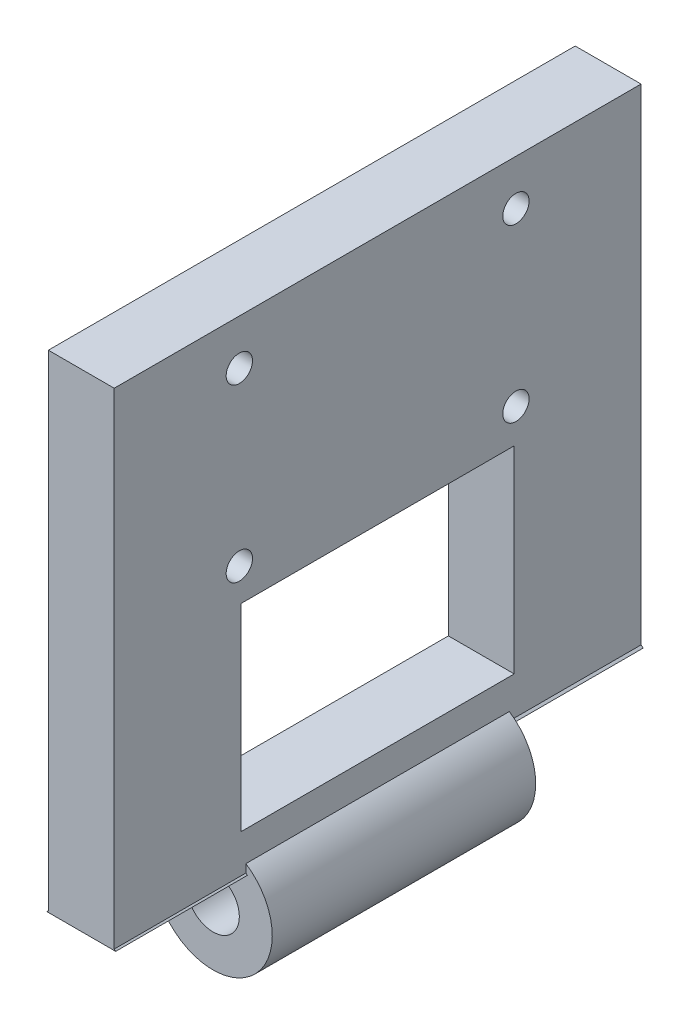
ISO-10303-21;
HEADER;
FILE_DESCRIPTION(('STEP AP214'),'2;1');
FILE_NAME('part.step','',(''),(''),'','','');
FILE_SCHEMA(('AUTOMOTIVE_DESIGN { 1 0 10303 214 1 1 1 1 }'));
ENDSEC;
DATA;
#1=APPLICATION_CONTEXT('core data for automotive mechanical design processes');
#2=APPLICATION_PROTOCOL_DEFINITION('international standard','automotive_design',2000,#1);
#3=PRODUCT_CONTEXT('',#1,'mechanical');
#4=PRODUCT('Part','Part','',(#3));
#5=PRODUCT_RELATED_PRODUCT_CATEGORY('part','',(#4));
#6=PRODUCT_DEFINITION_FORMATION('','',#4);
#7=PRODUCT_DEFINITION_CONTEXT('part definition',#1,'design');
#8=PRODUCT_DEFINITION('design','',#6,#7);
#9=PRODUCT_DEFINITION_SHAPE('','',#8);
#10=(LENGTH_UNIT() NAMED_UNIT(*) SI_UNIT(.MILLI.,.METRE.));
#11=(NAMED_UNIT(*) PLANE_ANGLE_UNIT() SI_UNIT($,.RADIAN.));
#12=(NAMED_UNIT(*) SI_UNIT($,.STERADIAN.) SOLID_ANGLE_UNIT());
#13=UNCERTAINTY_MEASURE_WITH_UNIT(LENGTH_MEASURE(1.E-05),#10,'distance_accuracy_value','');
#14=(GEOMETRIC_REPRESENTATION_CONTEXT(3) GLOBAL_UNCERTAINTY_ASSIGNED_CONTEXT((#13)) GLOBAL_UNIT_ASSIGNED_CONTEXT((#10,
#11,#12)) REPRESENTATION_CONTEXT('',''));
#15=CARTESIAN_POINT('',(0.,0.,0.));
#16=DIRECTION('',(0.,0.,1.));
#17=DIRECTION('',(1.,0.,0.));
#18=AXIS2_PLACEMENT_3D('',#15,#16,#17);
#19=CARTESIAN_POINT('',(5.,0.,0.));
#20=DIRECTION('',(-1.,0.,0.));
#21=DIRECTION('',(0.,0.,1.));
#22=AXIS2_PLACEMENT_3D('',#19,#20,#21);
#23=PLANE('',#22);
#24=CARTESIAN_POINT('',(5.,16.5612494995996,10.5));
#25=DIRECTION('',(1.,0.,0.));
#26=DIRECTION('',(0.,0.,-1.));
#27=AXIS2_PLACEMENT_3D('',#24,#25,#26);
#28=CIRCLE('',#27,1.);
#29=CARTESIAN_POINT('',(5.,16.5612494995996,9.5));
#30=VERTEX_POINT('',#29);
#31=EDGE_CURVE('E219',#30,#30,#28,.T.);
#32=ORIENTED_EDGE('',*,*,#31,.F.);
#33=EDGE_LOOP('',(#32));
#34=FACE_BOUND('',#33,.T.);
#35=CARTESIAN_POINT('',(5.,16.5612494995996,-10.5));
#36=DIRECTION('',(1.,0.,0.));
#37=DIRECTION('',(0.,0.,1.));
#38=AXIS2_PLACEMENT_3D('',#35,#36,#37);
#39=CIRCLE('',#38,1.);
#40=CARTESIAN_POINT('',(5.,16.5612494995996,-9.5));
#41=VERTEX_POINT('',#40);
#42=EDGE_CURVE('E216',#41,#41,#39,.T.);
#43=ORIENTED_EDGE('',*,*,#42,.F.);
#44=EDGE_LOOP('',(#43));
#45=FACE_BOUND('',#44,.T.);
#46=CARTESIAN_POINT('',(5.,3.5612494995996,-10.5));
#47=DIRECTION('',(1.,0.,0.));
#48=DIRECTION('',(0.,0.,-1.));
#49=AXIS2_PLACEMENT_3D('',#46,#47,#48);
#50=CIRCLE('',#49,1.);
#51=CARTESIAN_POINT('',(5.,3.5612494995996,-11.5));
#52=VERTEX_POINT('',#51);
#53=EDGE_CURVE('E220',#52,#52,#50,.T.);
#54=ORIENTED_EDGE('',*,*,#53,.F.);
#55=EDGE_LOOP('',(#54));
#56=FACE_BOUND('',#55,.T.);
#57=CARTESIAN_POINT('',(5.,3.56124949959959,10.5));
#58=DIRECTION('',(1.,0.,0.));
#59=DIRECTION('',(0.,0.,1.));
#60=AXIS2_PLACEMENT_3D('',#57,#58,#59);
#61=CIRCLE('',#60,1.);
#62=CARTESIAN_POINT('',(5.,3.56124949959959,11.5));
#63=VERTEX_POINT('',#62);
#64=EDGE_CURVE('E211',#63,#63,#61,.T.);
#65=ORIENTED_EDGE('',*,*,#64,.F.);
#66=EDGE_LOOP('',(#65));
#67=FACE_BOUND('',#66,.T.);
#68=DIRECTION('',(0.,1.,0.));
#69=VECTOR('',#68,1.);
#70=CARTESIAN_POINT('',(5.,-13.9716261909295,-10.3704912385666));
#71=LINE('',#70,#69);
#72=CARTESIAN_POINT('',(5.,-13.9716261909295,-10.3704912385666));
#73=VERTEX_POINT('',#72);
#74=CARTESIAN_POINT('',(5.,1.02837380907055,-10.3704912385666));
#75=VERTEX_POINT('',#74);
#76=EDGE_CURVE('E200',#73,#75,#71,.T.);
#77=ORIENTED_EDGE('',*,*,#76,.F.);
#78=DIRECTION('',(0.,0.,-1.));
#79=VECTOR('',#78,1.);
#80=CARTESIAN_POINT('',(5.,-13.9716261909295,10.3704912385666));
#81=LINE('',#80,#79);
#82=CARTESIAN_POINT('',(5.,-13.9716261909295,10.3704912385666));
#83=VERTEX_POINT('',#82);
#84=EDGE_CURVE('E62',#83,#73,#81,.T.);
#85=ORIENTED_EDGE('',*,*,#84,.F.);
#86=DIRECTION('',(0.,-1.,0.));
#87=VECTOR('',#86,1.);
#88=CARTESIAN_POINT('',(5.,-13.9716261909295,10.3704912385666));
#89=LINE('',#88,#87);
#90=CARTESIAN_POINT('',(5.,1.02837380907055,10.3704912385666));
#91=VERTEX_POINT('',#90);
#92=EDGE_CURVE('E205',#91,#83,#89,.T.);
#93=ORIENTED_EDGE('',*,*,#92,.F.);
#94=DIRECTION('',(0.,0.,1.));
#95=VECTOR('',#94,1.);
#96=CARTESIAN_POINT('',(5.,1.02837380907055,10.3704912385666));
#97=LINE('',#96,#95);
#98=EDGE_CURVE('E202',#75,#91,#97,.T.);
#99=ORIENTED_EDGE('',*,*,#98,.F.);
#100=EDGE_LOOP('',(#77,#85,#93,#99));
#101=FACE_BOUND('',#100,.T.);
#102=DIRECTION('',(0.,1.,0.));
#103=VECTOR('',#102,1.);
#104=CARTESIAN_POINT('',(5.,0.,-10.));
#105=LINE('',#104,#103);
#106=CARTESIAN_POINT('',(5.,-16.8775010008008,-9.99999999999999));
#107=VERTEX_POINT('',#106);
#108=CARTESIAN_POINT('',(5.,-16.2583426132261,-10.));
#109=VERTEX_POINT('',#108);
#110=EDGE_CURVE('E171',#107,#109,#105,.T.);
#111=ORIENTED_EDGE('',*,*,#110,.F.);
#112=DIRECTION('',(0.,0.,1.));
#113=VECTOR('',#112,1.);
#114=CARTESIAN_POINT('',(5.,-16.8775010008008,-31.3137084989848));
#115=LINE('',#114,#113);
#116=CARTESIAN_POINT('',(5.,-16.8775010008008,-20.));
#117=VERTEX_POINT('',#116);
#118=EDGE_CURVE('E242',#107,#117,#115,.F.);
#119=ORIENTED_EDGE('',*,*,#118,.T.);
#120=DIRECTION('',(0.,1.,0.));
#121=VECTOR('',#120,1.);
#122=CARTESIAN_POINT('',(5.,-20.,-20.));
#123=LINE('',#122,#121);
#124=CARTESIAN_POINT('',(5.,20.,-20.));
#125=VERTEX_POINT('',#124);
#126=EDGE_CURVE('E251',#117,#125,#123,.T.);
#127=ORIENTED_EDGE('',*,*,#126,.T.);
#128=DIRECTION('',(0.,0.,1.));
#129=VECTOR('',#128,1.);
#130=CARTESIAN_POINT('',(5.,20.,20.));
#131=LINE('',#130,#129);
#132=CARTESIAN_POINT('',(5.,20.,20.));
#133=VERTEX_POINT('',#132);
#134=EDGE_CURVE('E254',#125,#133,#131,.T.);
#135=ORIENTED_EDGE('',*,*,#134,.T.);
#136=DIRECTION('',(0.,-1.,0.));
#137=VECTOR('',#136,1.);
#138=CARTESIAN_POINT('',(5.,-20.,20.));
#139=LINE('',#138,#137);
#140=CARTESIAN_POINT('',(5.,-16.8775010008008,20.));
#141=VERTEX_POINT('',#140);
#142=EDGE_CURVE('E249',#133,#141,#139,.T.);
#143=ORIENTED_EDGE('',*,*,#142,.T.);
#144=CARTESIAN_POINT('',(5.,-16.8775010008008,10.));
#145=VERTEX_POINT('',#144);
#146=EDGE_CURVE('E185',#141,#145,#115,.F.);
#147=ORIENTED_EDGE('',*,*,#146,.T.);
#148=DIRECTION('',(0.,1.,0.));
#149=VECTOR('',#148,1.);
#150=CARTESIAN_POINT('',(5.,0.,10.));
#151=LINE('',#150,#149);
#152=CARTESIAN_POINT('',(5.,-16.2583426132261,10.));
#153=VERTEX_POINT('',#152);
#154=EDGE_CURVE('E176',#145,#153,#151,.T.);
#155=ORIENTED_EDGE('',*,*,#154,.T.);
#156=DIRECTION('',(0.,0.,1.));
#157=VECTOR('',#156,1.);
#158=CARTESIAN_POINT('',(5.,-16.2583426132261,-10.));
#159=LINE('',#158,#157);
#160=EDGE_CURVE('E161',#153,#109,#159,.F.);
#161=ORIENTED_EDGE('',*,*,#160,.T.);
#162=EDGE_LOOP('',(#111,#119,#127,#135,#143,#147,#155,#161));
#163=FACE_BOUND('',#162,.T.);
#164=ADVANCED_FACE('F47',(#34,#45,#56,#67,#101,#163),#23,.F.);
#165=CARTESIAN_POINT('',(0.,0.,0.));
#166=DIRECTION('',(-1.,0.,0.));
#167=DIRECTION('',(0.,0.,1.));
#168=AXIS2_PLACEMENT_3D('',#165,#166,#167);
#169=PLANE('',#168);
#170=DIRECTION('',(0.,0.,1.));
#171=VECTOR('',#170,1.);
#172=CARTESIAN_POINT('',(0.,-13.9716261909295,0.));
#173=LINE('',#172,#171);
#174=CARTESIAN_POINT('',(0.,-13.9716261909295,-10.3704912385666));
#175=VERTEX_POINT('',#174);
#176=CARTESIAN_POINT('',(0.,-13.9716261909295,10.3704912385666));
#177=VERTEX_POINT('',#176);
#178=EDGE_CURVE('E55',#175,#177,#173,.T.);
#179=ORIENTED_EDGE('',*,*,#178,.F.);
#180=DIRECTION('',(0.,-1.,0.));
#181=VECTOR('',#180,1.);
#182=CARTESIAN_POINT('',(0.,0.,-10.3704912385666));
#183=LINE('',#182,#181);
#184=CARTESIAN_POINT('',(0.,1.02837380907055,-10.3704912385666));
#185=VERTEX_POINT('',#184);
#186=EDGE_CURVE('E281',#185,#175,#183,.T.);
#187=ORIENTED_EDGE('',*,*,#186,.F.);
#188=DIRECTION('',(0.,0.,-1.));
#189=VECTOR('',#188,1.);
#190=CARTESIAN_POINT('',(0.,1.02837380907055,0.));
#191=LINE('',#190,#189);
#192=CARTESIAN_POINT('',(0.,1.02837380907055,10.3704912385666));
#193=VERTEX_POINT('',#192);
#194=EDGE_CURVE('E293',#193,#185,#191,.T.);
#195=ORIENTED_EDGE('',*,*,#194,.F.);
#196=DIRECTION('',(0.,1.,0.));
#197=VECTOR('',#196,1.);
#198=CARTESIAN_POINT('',(0.,0.,10.3704912385666));
#199=LINE('',#198,#197);
#200=EDGE_CURVE('E295',#177,#193,#199,.T.);
#201=ORIENTED_EDGE('',*,*,#200,.F.);
#202=EDGE_LOOP('',(#179,#187,#195,#201));
#203=FACE_BOUND('',#202,.T.);
#204=CARTESIAN_POINT('',(0.,3.56124949959959,10.5));
#205=DIRECTION('',(-1.,0.,0.));
#206=DIRECTION('',(0.,0.,1.));
#207=AXIS2_PLACEMENT_3D('',#204,#205,#206);
#208=CIRCLE('',#207,1.);
#209=CARTESIAN_POINT('',(0.,3.56124949959959,11.5));
#210=VERTEX_POINT('',#209);
#211=EDGE_CURVE('E233',#210,#210,#208,.T.);
#212=ORIENTED_EDGE('',*,*,#211,.F.);
#213=EDGE_LOOP('',(#212));
#214=FACE_BOUND('',#213,.T.);
#215=CARTESIAN_POINT('',(0.,3.5612494995996,-10.5));
#216=DIRECTION('',(-1.,0.,0.));
#217=DIRECTION('',(0.,0.,1.));
#218=AXIS2_PLACEMENT_3D('',#215,#216,#217);
#219=CIRCLE('',#218,1.);
#220=CARTESIAN_POINT('',(0.,3.5612494995996,-9.5));
#221=VERTEX_POINT('',#220);
#222=EDGE_CURVE('E287',#221,#221,#219,.T.);
#223=ORIENTED_EDGE('',*,*,#222,.F.);
#224=EDGE_LOOP('',(#223));
#225=FACE_BOUND('',#224,.T.);
#226=CARTESIAN_POINT('',(0.,16.5612494995996,-10.5));
#227=DIRECTION('',(-1.,0.,0.));
#228=DIRECTION('',(0.,0.,1.));
#229=AXIS2_PLACEMENT_3D('',#226,#227,#228);
#230=CIRCLE('',#229,1.);
#231=CARTESIAN_POINT('',(0.,16.5612494995996,-9.5));
#232=VERTEX_POINT('',#231);
#233=EDGE_CURVE('E284',#232,#232,#230,.T.);
#234=ORIENTED_EDGE('',*,*,#233,.F.);
#235=EDGE_LOOP('',(#234));
#236=FACE_BOUND('',#235,.T.);
#237=CARTESIAN_POINT('',(0.,16.5612494995996,10.5));
#238=DIRECTION('',(-1.,0.,0.));
#239=DIRECTION('',(0.,0.,1.));
#240=AXIS2_PLACEMENT_3D('',#237,#238,#239);
#241=CIRCLE('',#240,1.);
#242=CARTESIAN_POINT('',(0.,16.5612494995996,11.5));
#243=VERTEX_POINT('',#242);
#244=EDGE_CURVE('E227',#243,#243,#241,.T.);
#245=ORIENTED_EDGE('',*,*,#244,.F.);
#246=EDGE_LOOP('',(#245));
#247=FACE_BOUND('',#246,.T.);
#248=DIRECTION('',(0.,0.,1.));
#249=VECTOR('',#248,1.);
#250=CARTESIAN_POINT('',(0.,-16.8775010008008,-31.3137084989848));
#251=LINE('',#250,#249);
#252=CARTESIAN_POINT('',(0.,-16.8775010008008,-9.99999999999999));
#253=VERTEX_POINT('',#252);
#254=CARTESIAN_POINT('',(0.,-16.8775010008008,-20.));
#255=VERTEX_POINT('',#254);
#256=EDGE_CURVE('E267',#253,#255,#251,.F.);
#257=ORIENTED_EDGE('',*,*,#256,.F.);
#258=DIRECTION('',(0.,1.,0.));
#259=VECTOR('',#258,1.);
#260=CARTESIAN_POINT('',(0.,0.,-10.));
#261=LINE('',#260,#259);
#262=CARTESIAN_POINT('',(0.,-16.2583426132261,-10.));
#263=VERTEX_POINT('',#262);
#264=EDGE_CURVE('E195',#253,#263,#261,.T.);
#265=ORIENTED_EDGE('',*,*,#264,.T.);
#266=DIRECTION('',(0.,0.,1.));
#267=VECTOR('',#266,1.);
#268=CARTESIAN_POINT('',(0.,-16.2583426132261,-10.));
#269=LINE('',#268,#267);
#270=CARTESIAN_POINT('',(0.,-16.2583426132261,10.));
#271=VERTEX_POINT('',#270);
#272=EDGE_CURVE('E11',#271,#263,#269,.F.);
#273=ORIENTED_EDGE('',*,*,#272,.F.);
#274=DIRECTION('',(0.,1.,0.));
#275=VECTOR('',#274,1.);
#276=CARTESIAN_POINT('',(0.,0.,10.));
#277=LINE('',#276,#275);
#278=CARTESIAN_POINT('',(0.,-16.8775010008008,10.));
#279=VERTEX_POINT('',#278);
#280=EDGE_CURVE('E179',#279,#271,#277,.T.);
#281=ORIENTED_EDGE('',*,*,#280,.F.);
#282=CARTESIAN_POINT('',(0.,-16.8775010008008,20.));
#283=VERTEX_POINT('',#282);
#284=EDGE_CURVE('E268',#283,#279,#251,.F.);
#285=ORIENTED_EDGE('',*,*,#284,.F.);
#286=DIRECTION('',(0.,-1.,0.));
#287=VECTOR('',#286,1.);
#288=CARTESIAN_POINT('',(0.,-20.,20.));
#289=LINE('',#288,#287);
#290=CARTESIAN_POINT('',(0.,20.,20.));
#291=VERTEX_POINT('',#290);
#292=EDGE_CURVE('E248',#291,#283,#289,.T.);
#293=ORIENTED_EDGE('',*,*,#292,.F.);
#294=DIRECTION('',(0.,0.,1.));
#295=VECTOR('',#294,1.);
#296=CARTESIAN_POINT('',(0.,20.,20.));
#297=LINE('',#296,#295);
#298=CARTESIAN_POINT('',(0.,20.,-20.));
#299=VERTEX_POINT('',#298);
#300=EDGE_CURVE('E252',#299,#291,#297,.T.);
#301=ORIENTED_EDGE('',*,*,#300,.F.);
#302=DIRECTION('',(0.,1.,0.));
#303=VECTOR('',#302,1.);
#304=CARTESIAN_POINT('',(0.,-20.,-20.));
#305=LINE('',#304,#303);
#306=EDGE_CURVE('E259',#255,#299,#305,.T.);
#307=ORIENTED_EDGE('',*,*,#306,.F.);
#308=EDGE_LOOP('',(#257,#265,#273,#281,#285,#293,#301,#307));
#309=FACE_BOUND('',#308,.T.);
#310=ADVANCED_FACE('F307',(#203,#214,#225,#236,#247,#309),#169,.T.);
#311=CARTESIAN_POINT('',(2.5,-20.,-31.3137084989848));
#312=DIRECTION('',(0.,0.,1.));
#313=DIRECTION('',(1.,0.,0.));
#314=AXIS2_PLACEMENT_3D('',#311,#312,#313);
#315=CYLINDRICAL_SURFACE('',#314,4.);
#316=DIRECTION('',(0.,0.,1.));
#317=VECTOR('',#316,1.);
#318=CARTESIAN_POINT('',(-0.158312635337503,-17.011124972033,-31.3137084989848));
#319=LINE('',#318,#317);
#320=CARTESIAN_POINT('',(-0.158312635337512,-17.011124972033,-10.));
#321=VERTEX_POINT('',#320);
#322=CARTESIAN_POINT('',(-0.158312635337507,-17.011124972033,-20.));
#323=VERTEX_POINT('',#322);
#324=EDGE_CURVE('E274',#321,#323,#319,.F.);
#325=ORIENTED_EDGE('',*,*,#324,.F.);
#326=CARTESIAN_POINT('',(2.5,-20.,-9.99999999999999));
#327=DIRECTION('',(0.,0.,1.));
#328=DIRECTION('',(1.,0.,0.));
#329=AXIS2_PLACEMENT_3D('',#326,#327,#328);
#330=CIRCLE('',#329,4.);
#331=EDGE_CURVE('E188',#321,#253,#330,.F.);
#332=ORIENTED_EDGE('',*,*,#331,.T.);
#333=ORIENTED_EDGE('',*,*,#256,.T.);
#334=CARTESIAN_POINT('',(2.5,-20.,-20.));
#335=DIRECTION('',(0.,0.,1.));
#336=DIRECTION('',(0.,-1.,0.));
#337=AXIS2_PLACEMENT_3D('',#334,#335,#336);
#338=CIRCLE('',#337,4.);
#339=EDGE_CURVE('E243',#323,#255,#338,.F.);
#340=ORIENTED_EDGE('',*,*,#339,.F.);
#341=EDGE_LOOP('',(#325,#332,#333,#340));
#342=FACE_BOUND('',#341,.T.);
#343=ADVANCED_FACE('F331',(#342),#315,.T.);
#344=ORIENTED_EDGE('',*,*,#118,.F.);
#345=CARTESIAN_POINT('',(5.15831263533751,-17.011124972033,-10.));
#346=VERTEX_POINT('',#345);
#347=EDGE_CURVE('E186',#107,#346,#330,.F.);
#348=ORIENTED_EDGE('',*,*,#347,.T.);
#349=DIRECTION('',(0.,0.,1.));
#350=VECTOR('',#349,1.);
#351=CARTESIAN_POINT('',(5.1583126353375,-17.011124972033,-31.3137084989848));
#352=LINE('',#351,#350);
#353=CARTESIAN_POINT('',(5.15831263533751,-17.011124972033,-20.));
#354=VERTEX_POINT('',#353);
#355=EDGE_CURVE('E271',#354,#346,#352,.T.);
#356=ORIENTED_EDGE('',*,*,#355,.F.);
#357=EDGE_CURVE('E239',#117,#354,#338,.F.);
#358=ORIENTED_EDGE('',*,*,#357,.F.);
#359=EDGE_LOOP('',(#344,#348,#356,#358));
#360=FACE_BOUND('',#359,.T.);
#361=ADVANCED_FACE('F359',(#360),#315,.T.);
#362=CARTESIAN_POINT('',(2.5,-20.,10.));
#363=DIRECTION('',(0.,0.,1.));
#364=DIRECTION('',(1.,0.,0.));
#365=AXIS2_PLACEMENT_3D('',#362,#363,#364);
#366=CIRCLE('',#365,4.);
#367=CARTESIAN_POINT('',(-0.11362988722238,-16.9719744365977,10.));
#368=VERTEX_POINT('',#367);
#369=EDGE_CURVE('E190',#368,#279,#366,.F.);
#370=ORIENTED_EDGE('',*,*,#369,.F.);
#371=DIRECTION('',(0.,0.,1.));
#372=VECTOR('',#371,1.);
#373=CARTESIAN_POINT('',(-0.11362988722238,-16.9719744365977,-31.3137084989848));
#374=LINE('',#373,#372);
#375=CARTESIAN_POINT('',(-0.11362988722238,-16.9719744365977,20.));
#376=VERTEX_POINT('',#375);
#377=EDGE_CURVE('E278',#376,#368,#374,.F.);
#378=ORIENTED_EDGE('',*,*,#377,.F.);
#379=CARTESIAN_POINT('',(2.5,-20.,20.));
#380=DIRECTION('',(0.,0.,1.));
#381=DIRECTION('',(1.,0.,0.));
#382=AXIS2_PLACEMENT_3D('',#379,#380,#381);
#383=CIRCLE('',#382,4.);
#384=EDGE_CURVE('E244',#283,#376,#383,.T.);
#385=ORIENTED_EDGE('',*,*,#384,.F.);
#386=ORIENTED_EDGE('',*,*,#284,.T.);
#387=EDGE_LOOP('',(#370,#378,#385,#386));
#388=FACE_BOUND('',#387,.T.);
#389=ADVANCED_FACE('F348',(#388),#315,.T.);
#390=CARTESIAN_POINT('',(5.,-20.,20.));
#391=DIRECTION('',(0.,0.,-1.));
#392=DIRECTION('',(-1.,0.,0.));
#393=AXIS2_PLACEMENT_3D('',#390,#391,#392);
#394=PLANE('',#393);
#395=ORIENTED_EDGE('',*,*,#384,.T.);
#396=DIRECTION('',(-1.,0.,0.));
#397=VECTOR('',#396,1.);
#398=CARTESIAN_POINT('',(-4.09406400103508,-16.9719744365977,20.));
#399=LINE('',#398,#397);
#400=CARTESIAN_POINT('',(5.11362988722238,-16.9719744365977,20.));
#401=VERTEX_POINT('',#400);
#402=EDGE_CURVE('E231',#401,#376,#399,.T.);
#403=ORIENTED_EDGE('',*,*,#402,.F.);
#404=EDGE_CURVE('E237',#401,#141,#383,.T.);
#405=ORIENTED_EDGE('',*,*,#404,.T.);
#406=ORIENTED_EDGE('',*,*,#142,.F.);
#407=DIRECTION('',(-1.,0.,0.));
#408=VECTOR('',#407,1.);
#409=CARTESIAN_POINT('',(5.,20.,20.));
#410=LINE('',#409,#408);
#411=EDGE_CURVE('E256',#133,#291,#410,.T.);
#412=ORIENTED_EDGE('',*,*,#411,.T.);
#413=ORIENTED_EDGE('',*,*,#292,.T.);
#414=EDGE_LOOP('',(#395,#403,#405,#406,#412,#413));
#415=FACE_BOUND('',#414,.T.);
#416=ADVANCED_FACE('F49',(#415),#394,.F.);
#417=CARTESIAN_POINT('',(5.,-20.,-20.));
#418=DIRECTION('',(0.,0.,1.));
#419=DIRECTION('',(0.,-1.,0.));
#420=AXIS2_PLACEMENT_3D('',#417,#418,#419);
#421=PLANE('',#420);
#422=ORIENTED_EDGE('',*,*,#357,.T.);
#423=DIRECTION('',(1.,0.,0.));
#424=VECTOR('',#423,1.);
#425=CARTESIAN_POINT('',(7.32276626049872,-17.011124972033,-20.));
#426=LINE('',#425,#424);
#427=EDGE_CURVE('E230',#323,#354,#426,.T.);
#428=ORIENTED_EDGE('',*,*,#427,.F.);
#429=ORIENTED_EDGE('',*,*,#339,.T.);
#430=ORIENTED_EDGE('',*,*,#306,.T.);
#431=DIRECTION('',(-1.,0.,0.));
#432=VECTOR('',#431,1.);
#433=CARTESIAN_POINT('',(5.,20.,-20.));
#434=LINE('',#433,#432);
#435=EDGE_CURVE('E264',#125,#299,#434,.T.);
#436=ORIENTED_EDGE('',*,*,#435,.F.);
#437=ORIENTED_EDGE('',*,*,#126,.F.);
#438=EDGE_LOOP('',(#422,#428,#429,#430,#436,#437));
#439=FACE_BOUND('',#438,.T.);
#440=ADVANCED_FACE('F341',(#439),#421,.F.);
#441=CARTESIAN_POINT('',(5.,20.,20.));
#442=DIRECTION('',(0.,-1.,0.));
#443=DIRECTION('',(0.,0.,-1.));
#444=AXIS2_PLACEMENT_3D('',#441,#442,#443);
#445=PLANE('',#444);
#446=ORIENTED_EDGE('',*,*,#300,.T.);
#447=ORIENTED_EDGE('',*,*,#411,.F.);
#448=ORIENTED_EDGE('',*,*,#134,.F.);
#449=ORIENTED_EDGE('',*,*,#435,.T.);
#450=EDGE_LOOP('',(#446,#447,#448,#449));
#451=FACE_BOUND('',#450,.T.);
#452=ADVANCED_FACE('F339',(#451),#445,.F.);
#453=CARTESIAN_POINT('',(5.11362988722238,-16.9719744365977,10.));
#454=VERTEX_POINT('',#453);
#455=EDGE_CURVE('E378',#145,#454,#366,.F.);
#456=ORIENTED_EDGE('',*,*,#455,.F.);
#457=ORIENTED_EDGE('',*,*,#146,.F.);
#458=ORIENTED_EDGE('',*,*,#404,.F.);
#459=DIRECTION('',(0.,0.,1.));
#460=VECTOR('',#459,1.);
#461=CARTESIAN_POINT('',(5.11362988722238,-16.9719744365977,-31.3137084989848));
#462=LINE('',#461,#460);
#463=EDGE_CURVE('E276',#454,#401,#462,.T.);
#464=ORIENTED_EDGE('',*,*,#463,.F.);
#465=EDGE_LOOP('',(#456,#457,#458,#464));
#466=FACE_BOUND('',#465,.T.);
#467=ADVANCED_FACE('F336',(#466),#315,.T.);
#468=CARTESIAN_POINT('',(0.,0.,-10.));
#469=DIRECTION('',(0.,0.,1.));
#470=DIRECTION('',(0.,-1.,0.));
#471=AXIS2_PLACEMENT_3D('',#468,#469,#470);
#472=PLANE('',#471);
#473=CARTESIAN_POINT('',(2.5,-20.,-10.));
#474=DIRECTION('',(0.,0.,1.));
#475=DIRECTION('',(1.,0.,0.));
#476=AXIS2_PLACEMENT_3D('',#473,#474,#475);
#477=CIRCLE('',#476,2.);
#478=CARTESIAN_POINT('',(4.5,-20.,-10.));
#479=VERTEX_POINT('',#478);
#480=EDGE_CURVE('E180',#479,#479,#477,.T.);
#481=ORIENTED_EDGE('',*,*,#480,.T.);
#482=EDGE_LOOP('',(#481));
#483=FACE_BOUND('',#482,.T.);
#484=DIRECTION('',(1.,0.,0.));
#485=VECTOR('',#484,1.);
#486=CARTESIAN_POINT('',(7.32276626049872,-17.011124972033,-10.));
#487=LINE('',#486,#485);
#488=EDGE_CURVE('E234',#321,#346,#487,.T.);
#489=ORIENTED_EDGE('',*,*,#488,.T.);
#490=ORIENTED_EDGE('',*,*,#347,.F.);
#491=ORIENTED_EDGE('',*,*,#110,.T.);
#492=CARTESIAN_POINT('',(2.5,-20.,-10.));
#493=DIRECTION('',(0.,0.,1.));
#494=DIRECTION('',(1.,0.,0.));
#495=AXIS2_PLACEMENT_3D('',#492,#493,#494);
#496=CIRCLE('',#495,4.5);
#497=EDGE_CURVE('E167',#263,#109,#496,.T.);
#498=ORIENTED_EDGE('',*,*,#497,.F.);
#499=ORIENTED_EDGE('',*,*,#264,.F.);
#500=ORIENTED_EDGE('',*,*,#331,.F.);
#501=EDGE_LOOP('',(#489,#490,#491,#498,#499,#500));
#502=FACE_BOUND('',#501,.T.);
#503=ADVANCED_FACE('F388',(#483,#502),#472,.F.);
#504=CARTESIAN_POINT('',(7.32276626049872,-17.011124972033,-10.));
#505=DIRECTION('',(0.,1.,0.));
#506=DIRECTION('',(0.,0.,1.));
#507=AXIS2_PLACEMENT_3D('',#504,#505,#506);
#508=PLANE('',#507);
#509=ORIENTED_EDGE('',*,*,#324,.T.);
#510=ORIENTED_EDGE('',*,*,#427,.T.);
#511=ORIENTED_EDGE('',*,*,#355,.T.);
#512=ORIENTED_EDGE('',*,*,#488,.F.);
#513=EDGE_LOOP('',(#509,#510,#511,#512));
#514=FACE_BOUND('',#513,.T.);
#515=ADVANCED_FACE('F362',(#514),#508,.F.);
#516=CARTESIAN_POINT('',(0.,0.,10.));
#517=DIRECTION('',(0.,0.,-1.));
#518=DIRECTION('',(-1.,0.,0.));
#519=AXIS2_PLACEMENT_3D('',#516,#517,#518);
#520=PLANE('',#519);
#521=CARTESIAN_POINT('',(2.5,-20.,10.));
#522=DIRECTION('',(0.,0.,1.));
#523=DIRECTION('',(1.,0.,0.));
#524=AXIS2_PLACEMENT_3D('',#521,#522,#523);
#525=CIRCLE('',#524,2.);
#526=CARTESIAN_POINT('',(4.5,-20.,10.));
#527=VERTEX_POINT('',#526);
#528=EDGE_CURVE('E382',#527,#527,#525,.T.);
#529=ORIENTED_EDGE('',*,*,#528,.F.);
#530=EDGE_LOOP('',(#529));
#531=FACE_BOUND('',#530,.T.);
#532=DIRECTION('',(-1.,0.,0.));
#533=VECTOR('',#532,1.);
#534=CARTESIAN_POINT('',(-4.09406400103508,-16.9719744365977,10.));
#535=LINE('',#534,#533);
#536=EDGE_CURVE('E228',#454,#368,#535,.T.);
#537=ORIENTED_EDGE('',*,*,#536,.T.);
#538=ORIENTED_EDGE('',*,*,#369,.T.);
#539=ORIENTED_EDGE('',*,*,#280,.T.);
#540=CARTESIAN_POINT('',(2.5,-20.,10.));
#541=DIRECTION('',(0.,0.,1.));
#542=DIRECTION('',(1.,0.,0.));
#543=AXIS2_PLACEMENT_3D('',#540,#541,#542);
#544=CIRCLE('',#543,4.5);
#545=EDGE_CURVE('E164',#271,#153,#544,.T.);
#546=ORIENTED_EDGE('',*,*,#545,.T.);
#547=ORIENTED_EDGE('',*,*,#154,.F.);
#548=ORIENTED_EDGE('',*,*,#455,.T.);
#549=EDGE_LOOP('',(#537,#538,#539,#546,#547,#548));
#550=FACE_BOUND('',#549,.T.);
#551=ADVANCED_FACE('F175',(#531,#550),#520,.F.);
#552=CARTESIAN_POINT('',(-4.09406400103508,-16.9719744365977,10.));
#553=DIRECTION('',(0.,1.,0.));
#554=DIRECTION('',(0.,0.,1.));
#555=AXIS2_PLACEMENT_3D('',#552,#553,#554);
#556=PLANE('',#555);
#557=ORIENTED_EDGE('',*,*,#377,.T.);
#558=ORIENTED_EDGE('',*,*,#536,.F.);
#559=ORIENTED_EDGE('',*,*,#463,.T.);
#560=ORIENTED_EDGE('',*,*,#402,.T.);
#561=EDGE_LOOP('',(#557,#558,#559,#560));
#562=FACE_BOUND('',#561,.T.);
#563=ADVANCED_FACE('F397',(#562),#556,.F.);
#564=CARTESIAN_POINT('',(-1.5,16.5612494995996,10.5));
#565=DIRECTION('',(1.,0.,0.));
#566=DIRECTION('',(0.,0.,-1.));
#567=AXIS2_PLACEMENT_3D('',#564,#565,#566);
#568=CYLINDRICAL_SURFACE('',#567,1.);
#569=ORIENTED_EDGE('',*,*,#244,.T.);
#570=EDGE_LOOP('',(#569));
#571=FACE_BOUND('',#570,.T.);
#572=ORIENTED_EDGE('',*,*,#31,.T.);
#573=EDGE_LOOP('',(#572));
#574=FACE_BOUND('',#573,.T.);
#575=ADVANCED_FACE('F403',(#571,#574),#568,.F.);
#576=CARTESIAN_POINT('',(-1.5,16.5612494995996,-10.5));
#577=DIRECTION('',(1.,0.,0.));
#578=DIRECTION('',(0.,0.,-1.));
#579=AXIS2_PLACEMENT_3D('',#576,#577,#578);
#580=CYLINDRICAL_SURFACE('',#579,1.);
#581=ORIENTED_EDGE('',*,*,#233,.T.);
#582=EDGE_LOOP('',(#581));
#583=FACE_BOUND('',#582,.T.);
#584=ORIENTED_EDGE('',*,*,#42,.T.);
#585=EDGE_LOOP('',(#584));
#586=FACE_BOUND('',#585,.T.);
#587=ADVANCED_FACE('F482',(#583,#586),#580,.F.);
#588=CARTESIAN_POINT('',(-1.5,3.5612494995996,-10.5));
#589=DIRECTION('',(1.,0.,0.));
#590=DIRECTION('',(0.,0.,-1.));
#591=AXIS2_PLACEMENT_3D('',#588,#589,#590);
#592=CYLINDRICAL_SURFACE('',#591,1.);
#593=ORIENTED_EDGE('',*,*,#222,.T.);
#594=EDGE_LOOP('',(#593));
#595=FACE_BOUND('',#594,.T.);
#596=ORIENTED_EDGE('',*,*,#53,.T.);
#597=EDGE_LOOP('',(#596));
#598=FACE_BOUND('',#597,.T.);
#599=ADVANCED_FACE('F473',(#595,#598),#592,.F.);
#600=CARTESIAN_POINT('',(-1.5,3.56124949959959,10.5));
#601=DIRECTION('',(1.,0.,0.));
#602=DIRECTION('',(0.,0.,-1.));
#603=AXIS2_PLACEMENT_3D('',#600,#601,#602);
#604=CYLINDRICAL_SURFACE('',#603,1.);
#605=ORIENTED_EDGE('',*,*,#211,.T.);
#606=EDGE_LOOP('',(#605));
#607=FACE_BOUND('',#606,.T.);
#608=ORIENTED_EDGE('',*,*,#64,.T.);
#609=EDGE_LOOP('',(#608));
#610=FACE_BOUND('',#609,.T.);
#611=ADVANCED_FACE('F465',(#607,#610),#604,.F.);
#612=CARTESIAN_POINT('',(-1.5,-13.9716261909295,10.3704912385666));
#613=DIRECTION('',(0.,-1.,0.));
#614=DIRECTION('',(0.,0.,-1.));
#615=AXIS2_PLACEMENT_3D('',#612,#613,#614);
#616=PLANE('',#615);
#617=ORIENTED_EDGE('',*,*,#178,.T.);
#618=DIRECTION('',(1.,0.,0.));
#619=VECTOR('',#618,1.);
#620=CARTESIAN_POINT('',(-1.5,-13.9716261909295,10.3704912385666));
#621=LINE('',#620,#619);
#622=EDGE_CURVE('E209',#177,#83,#621,.T.);
#623=ORIENTED_EDGE('',*,*,#622,.T.);
#624=ORIENTED_EDGE('',*,*,#84,.T.);
#625=DIRECTION('',(1.,0.,0.));
#626=VECTOR('',#625,1.);
#627=CARTESIAN_POINT('',(-1.5,-13.9716261909295,-10.3704912385666));
#628=LINE('',#627,#626);
#629=EDGE_CURVE('E208',#175,#73,#628,.T.);
#630=ORIENTED_EDGE('',*,*,#629,.F.);
#631=EDGE_LOOP('',(#617,#623,#624,#630));
#632=FACE_BOUND('',#631,.T.);
#633=ADVANCED_FACE('F298',(#632),#616,.F.);
#634=CARTESIAN_POINT('',(-1.5,-13.9716261909295,10.3704912385666));
#635=DIRECTION('',(0.,0.,1.));
#636=DIRECTION('',(1.,0.,0.));
#637=AXIS2_PLACEMENT_3D('',#634,#635,#636);
#638=PLANE('',#637);
#639=ORIENTED_EDGE('',*,*,#200,.T.);
#640=DIRECTION('',(1.,0.,0.));
#641=VECTOR('',#640,1.);
#642=CARTESIAN_POINT('',(-1.5,1.02837380907055,10.3704912385666));
#643=LINE('',#642,#641);
#644=EDGE_CURVE('E212',#193,#91,#643,.T.);
#645=ORIENTED_EDGE('',*,*,#644,.T.);
#646=ORIENTED_EDGE('',*,*,#92,.T.);
#647=ORIENTED_EDGE('',*,*,#622,.F.);
#648=EDGE_LOOP('',(#639,#645,#646,#647));
#649=FACE_BOUND('',#648,.T.);
#650=ADVANCED_FACE('F303',(#649),#638,.F.);
#651=CARTESIAN_POINT('',(-1.5,1.02837380907055,10.3704912385666));
#652=DIRECTION('',(0.,1.,0.));
#653=DIRECTION('',(0.,0.,1.));
#654=AXIS2_PLACEMENT_3D('',#651,#652,#653);
#655=PLANE('',#654);
#656=ORIENTED_EDGE('',*,*,#194,.T.);
#657=DIRECTION('',(1.,0.,0.));
#658=VECTOR('',#657,1.);
#659=CARTESIAN_POINT('',(-1.5,1.02837380907055,-10.3704912385666));
#660=LINE('',#659,#658);
#661=EDGE_CURVE('E70',#185,#75,#660,.T.);
#662=ORIENTED_EDGE('',*,*,#661,.T.);
#663=ORIENTED_EDGE('',*,*,#98,.T.);
#664=ORIENTED_EDGE('',*,*,#644,.F.);
#665=EDGE_LOOP('',(#656,#662,#663,#664));
#666=FACE_BOUND('',#665,.T.);
#667=ADVANCED_FACE('F310',(#666),#655,.F.);
#668=CARTESIAN_POINT('',(-1.5,-13.9716261909295,-10.3704912385666));
#669=DIRECTION('',(0.,0.,-1.));
#670=DIRECTION('',(0.,1.,0.));
#671=AXIS2_PLACEMENT_3D('',#668,#669,#670);
#672=PLANE('',#671);
#673=ORIENTED_EDGE('',*,*,#186,.T.);
#674=ORIENTED_EDGE('',*,*,#629,.T.);
#675=ORIENTED_EDGE('',*,*,#76,.T.);
#676=ORIENTED_EDGE('',*,*,#661,.F.);
#677=EDGE_LOOP('',(#673,#674,#675,#676));
#678=FACE_BOUND('',#677,.T.);
#679=ADVANCED_FACE('F314',(#678),#672,.F.);
#680=CARTESIAN_POINT('',(2.5,-20.,-10.));
#681=DIRECTION('',(0.,0.,1.));
#682=DIRECTION('',(1.,0.,0.));
#683=AXIS2_PLACEMENT_3D('',#680,#681,#682);
#684=CYLINDRICAL_SURFACE('',#683,4.5);
#685=ORIENTED_EDGE('',*,*,#160,.F.);
#686=ORIENTED_EDGE('',*,*,#545,.F.);
#687=ORIENTED_EDGE('',*,*,#272,.T.);
#688=ORIENTED_EDGE('',*,*,#497,.T.);
#689=EDGE_LOOP('',(#685,#686,#687,#688));
#690=FACE_BOUND('',#689,.T.);
#691=ADVANCED_FACE('F163',(#690),#684,.T.);
#692=CARTESIAN_POINT('',(2.5,-20.,-10.));
#693=DIRECTION('',(0.,0.,1.));
#694=DIRECTION('',(1.,0.,0.));
#695=AXIS2_PLACEMENT_3D('',#692,#693,#694);
#696=CYLINDRICAL_SURFACE('',#695,2.);
#697=ORIENTED_EDGE('',*,*,#480,.F.);
#698=EDGE_LOOP('',(#697));
#699=FACE_BOUND('',#698,.T.);
#700=ORIENTED_EDGE('',*,*,#528,.T.);
#701=EDGE_LOOP('',(#700));
#702=FACE_BOUND('',#701,.T.);
#703=ADVANCED_FACE('F321',(#699,#702),#696,.F.);
#704=CLOSED_SHELL('',(#164,#310,#343,#361,#389,#416,#440,#452,#467,#503,#515,#551,#563,#575,
#587,#599,#611,#633,#650,#667,#679,#691,#703));
#705=MANIFOLD_SOLID_BREP('B2',#704);
#706=ADVANCED_BREP_SHAPE_REPRESENTATION('',(#18,#705),#14);
#707=SHAPE_DEFINITION_REPRESENTATION(#9,#706);
ENDSEC;
END-ISO-10303-21;
